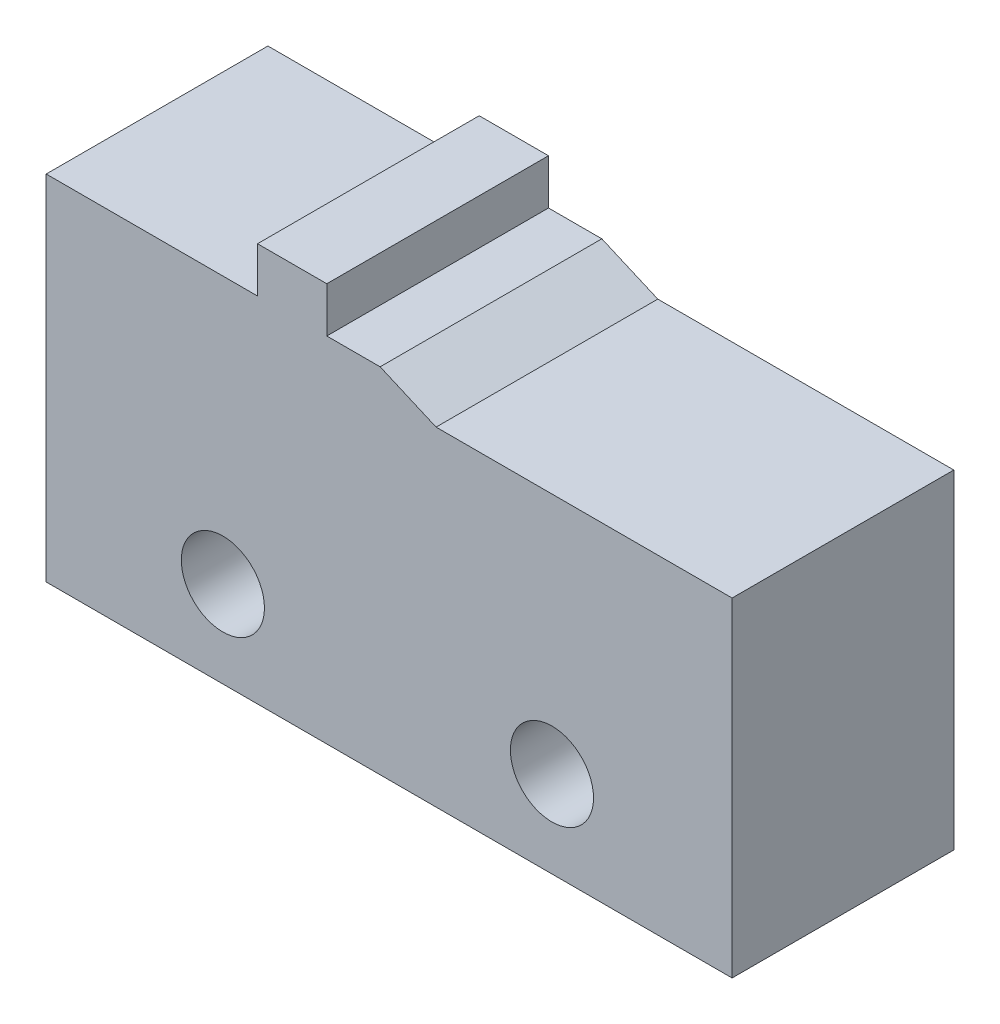
ISO-10303-21;
HEADER;
FILE_DESCRIPTION(('STEP AP214'),'2;1');
FILE_NAME('part.step','',(''),(''),'','','');
FILE_SCHEMA(('AUTOMOTIVE_DESIGN { 1 0 10303 214 1 1 1 1 }'));
ENDSEC;
DATA;
#1=APPLICATION_CONTEXT('core data for automotive mechanical design processes');
#2=APPLICATION_PROTOCOL_DEFINITION('international standard','automotive_design',2000,#1);
#3=PRODUCT_CONTEXT('',#1,'mechanical');
#4=PRODUCT('Part','Part','',(#3));
#5=PRODUCT_RELATED_PRODUCT_CATEGORY('part','',(#4));
#6=PRODUCT_DEFINITION_FORMATION('','',#4);
#7=PRODUCT_DEFINITION_CONTEXT('part definition',#1,'design');
#8=PRODUCT_DEFINITION('design','',#6,#7);
#9=PRODUCT_DEFINITION_SHAPE('','',#8);
#10=(LENGTH_UNIT() NAMED_UNIT(*) SI_UNIT(.MILLI.,.METRE.));
#11=(NAMED_UNIT(*) PLANE_ANGLE_UNIT() SI_UNIT($,.RADIAN.));
#12=(NAMED_UNIT(*) SI_UNIT($,.STERADIAN.) SOLID_ANGLE_UNIT());
#13=UNCERTAINTY_MEASURE_WITH_UNIT(LENGTH_MEASURE(1.E-05),#10,'distance_accuracy_value','');
#14=(GEOMETRIC_REPRESENTATION_CONTEXT(3) GLOBAL_UNCERTAINTY_ASSIGNED_CONTEXT((#13)) GLOBAL_UNIT_ASSIGNED_CONTEXT((#10,
#11,#12)) REPRESENTATION_CONTEXT('',''));
#15=CARTESIAN_POINT('',(0.,0.,0.));
#16=DIRECTION('',(0.,0.,1.));
#17=DIRECTION('',(1.,0.,0.));
#18=AXIS2_PLACEMENT_3D('',#15,#16,#17);
#19=CARTESIAN_POINT('',(0.,10.2,6.4));
#20=DIRECTION('',(0.,0.,-1.));
#21=DIRECTION('',(-1.,0.,0.));
#22=AXIS2_PLACEMENT_3D('',#19,#20,#21);
#23=PLANE('',#22);
#24=CARTESIAN_POINT('',(5.1,2.5,6.4));
#25=DIRECTION('',(0.,0.,1.));
#26=DIRECTION('',(1.,0.,0.));
#27=AXIS2_PLACEMENT_3D('',#24,#25,#26);
#28=CIRCLE('',#27,1.2);
#29=CARTESIAN_POINT('',(6.3,2.5,6.4));
#30=VERTEX_POINT('',#29);
#31=EDGE_CURVE('E147',#30,#30,#28,.T.);
#32=ORIENTED_EDGE('',*,*,#31,.F.);
#33=EDGE_LOOP('',(#32));
#34=FACE_BOUND('',#33,.T.);
#35=DIRECTION('',(0.,-1.,0.));
#36=VECTOR('',#35,1.);
#37=CARTESIAN_POINT('',(0.,0.,6.4));
#38=LINE('',#37,#36);
#39=CARTESIAN_POINT('',(0.,10.2,6.4));
#40=VERTEX_POINT('',#39);
#41=CARTESIAN_POINT('',(0.,0.,6.4));
#42=VERTEX_POINT('',#41);
#43=EDGE_CURVE('E162',#40,#42,#38,.T.);
#44=ORIENTED_EDGE('',*,*,#43,.T.);
#45=DIRECTION('',(1.,0.,0.));
#46=VECTOR('',#45,1.);
#47=CARTESIAN_POINT('',(0.,0.,6.4));
#48=LINE('',#47,#46);
#49=CARTESIAN_POINT('',(19.8,0.,6.4));
#50=VERTEX_POINT('',#49);
#51=EDGE_CURVE('E100',#42,#50,#48,.T.);
#52=ORIENTED_EDGE('',*,*,#51,.T.);
#53=DIRECTION('',(0.,1.,0.));
#54=VECTOR('',#53,1.);
#55=CARTESIAN_POINT('',(19.8,0.,6.4));
#56=LINE('',#55,#54);
#57=CARTESIAN_POINT('',(19.8,9.5,6.4));
#58=VERTEX_POINT('',#57);
#59=EDGE_CURVE('E183',#50,#58,#56,.T.);
#60=ORIENTED_EDGE('',*,*,#59,.T.);
#61=DIRECTION('',(-1.,0.,0.));
#62=VECTOR('',#61,1.);
#63=CARTESIAN_POINT('',(19.8,9.5,6.4));
#64=LINE('',#63,#62);
#65=CARTESIAN_POINT('',(11.254760894668,9.5,6.4));
#66=VERTEX_POINT('',#65);
#67=EDGE_CURVE('E202',#58,#66,#64,.T.);
#68=ORIENTED_EDGE('',*,*,#67,.T.);
#69=DIRECTION('',(-0.917500806613739,0.397733918421774,0.));
#70=VECTOR('',#69,1.);
#71=CARTESIAN_POINT('',(11.254760894668,9.5,6.4));
#72=LINE('',#71,#70);
#73=CARTESIAN_POINT('',(9.63998645657612,10.2,6.4));
#74=VERTEX_POINT('',#73);
#75=EDGE_CURVE('E199',#66,#74,#72,.T.);
#76=ORIENTED_EDGE('',*,*,#75,.T.);
#77=DIRECTION('',(-1.,0.,0.));
#78=VECTOR('',#77,1.);
#79=CARTESIAN_POINT('',(8.1,10.2,6.4));
#80=LINE('',#79,#78);
#81=CARTESIAN_POINT('',(8.1,10.2,6.4));
#82=VERTEX_POINT('',#81);
#83=EDGE_CURVE('E201',#74,#82,#80,.T.);
#84=ORIENTED_EDGE('',*,*,#83,.T.);
#85=DIRECTION('',(0.,1.,0.));
#86=VECTOR('',#85,1.);
#87=CARTESIAN_POINT('',(8.1,11.506737857765,6.4));
#88=LINE('',#87,#86);
#89=CARTESIAN_POINT('',(8.1,11.506737857765,6.4));
#90=VERTEX_POINT('',#89);
#91=EDGE_CURVE('E125',#82,#90,#88,.T.);
#92=ORIENTED_EDGE('',*,*,#91,.T.);
#93=DIRECTION('',(-1.,0.,0.));
#94=VECTOR('',#93,1.);
#95=CARTESIAN_POINT('',(6.1,11.506737857765,6.4));
#96=LINE('',#95,#94);
#97=CARTESIAN_POINT('',(6.1,11.506737857765,6.4));
#98=VERTEX_POINT('',#97);
#99=EDGE_CURVE('E119',#90,#98,#96,.T.);
#100=ORIENTED_EDGE('',*,*,#99,.T.);
#101=DIRECTION('',(0.,-1.,0.));
#102=VECTOR('',#101,1.);
#103=CARTESIAN_POINT('',(6.1,10.2,6.4));
#104=LINE('',#103,#102);
#105=CARTESIAN_POINT('',(6.1,10.2,6.4));
#106=VERTEX_POINT('',#105);
#107=EDGE_CURVE('E123',#98,#106,#104,.T.);
#108=ORIENTED_EDGE('',*,*,#107,.T.);
#109=DIRECTION('',(-1.,0.,0.));
#110=VECTOR('',#109,1.);
#111=CARTESIAN_POINT('',(0.,10.2,6.4));
#112=LINE('',#111,#110);
#113=EDGE_CURVE('E51',#106,#40,#112,.T.);
#114=ORIENTED_EDGE('',*,*,#113,.T.);
#115=EDGE_LOOP('',(#44,#52,#60,#68,#76,#84,#92,#100,#108,#114));
#116=FACE_BOUND('',#115,.T.);
#117=CARTESIAN_POINT('',(14.6,2.5,6.4));
#118=DIRECTION('',(0.,0.,1.));
#119=DIRECTION('',(1.,0.,0.));
#120=AXIS2_PLACEMENT_3D('',#117,#118,#119);
#121=CIRCLE('',#120,1.2);
#122=CARTESIAN_POINT('',(15.8,2.5,6.4));
#123=VERTEX_POINT('',#122);
#124=EDGE_CURVE('E213',#123,#123,#121,.T.);
#125=ORIENTED_EDGE('',*,*,#124,.F.);
#126=EDGE_LOOP('',(#125));
#127=FACE_BOUND('',#126,.T.);
#128=ADVANCED_FACE('F34',(#34,#116,#127),#23,.F.);
#129=CARTESIAN_POINT('',(0.,10.2,0.));
#130=DIRECTION('',(0.,0.,-1.));
#131=DIRECTION('',(-1.,0.,0.));
#132=AXIS2_PLACEMENT_3D('',#129,#130,#131);
#133=PLANE('',#132);
#134=CARTESIAN_POINT('',(5.1,2.5,0.));
#135=DIRECTION('',(0.,0.,1.));
#136=DIRECTION('',(1.,0.,0.));
#137=AXIS2_PLACEMENT_3D('',#134,#135,#136);
#138=CIRCLE('',#137,1.2);
#139=CARTESIAN_POINT('',(6.3,2.5,0.));
#140=VERTEX_POINT('',#139);
#141=EDGE_CURVE('E210',#140,#140,#138,.T.);
#142=ORIENTED_EDGE('',*,*,#141,.T.);
#143=EDGE_LOOP('',(#142));
#144=FACE_BOUND('',#143,.T.);
#145=DIRECTION('',(0.,-1.,0.));
#146=VECTOR('',#145,1.);
#147=CARTESIAN_POINT('',(0.,0.,0.));
#148=LINE('',#147,#146);
#149=CARTESIAN_POINT('',(0.,10.2,0.));
#150=VERTEX_POINT('',#149);
#151=CARTESIAN_POINT('',(0.,0.,0.));
#152=VERTEX_POINT('',#151);
#153=EDGE_CURVE('E143',#150,#152,#148,.T.);
#154=ORIENTED_EDGE('',*,*,#153,.F.);
#155=DIRECTION('',(-1.,0.,0.));
#156=VECTOR('',#155,1.);
#157=CARTESIAN_POINT('',(0.,10.2,0.));
#158=LINE('',#157,#156);
#159=CARTESIAN_POINT('',(6.1,10.2,0.));
#160=VERTEX_POINT('',#159);
#161=EDGE_CURVE('E92',#160,#150,#158,.T.);
#162=ORIENTED_EDGE('',*,*,#161,.F.);
#163=DIRECTION('',(0.,-1.,0.));
#164=VECTOR('',#163,1.);
#165=CARTESIAN_POINT('',(6.1,10.2,0.));
#166=LINE('',#165,#164);
#167=CARTESIAN_POINT('',(6.1,11.506737857765,0.));
#168=VERTEX_POINT('',#167);
#169=EDGE_CURVE('E86',#168,#160,#166,.T.);
#170=ORIENTED_EDGE('',*,*,#169,.F.);
#171=DIRECTION('',(-1.,0.,0.));
#172=VECTOR('',#171,1.);
#173=CARTESIAN_POINT('',(6.1,11.506737857765,0.));
#174=LINE('',#173,#172);
#175=CARTESIAN_POINT('',(8.1,11.506737857765,0.));
#176=VERTEX_POINT('',#175);
#177=EDGE_CURVE('E133',#176,#168,#174,.T.);
#178=ORIENTED_EDGE('',*,*,#177,.F.);
#179=DIRECTION('',(0.,1.,0.));
#180=VECTOR('',#179,1.);
#181=CARTESIAN_POINT('',(8.1,11.506737857765,0.));
#182=LINE('',#181,#180);
#183=CARTESIAN_POINT('',(8.1,10.2,0.));
#184=VERTEX_POINT('',#183);
#185=EDGE_CURVE('E157',#184,#176,#182,.T.);
#186=ORIENTED_EDGE('',*,*,#185,.F.);
#187=DIRECTION('',(-1.,0.,0.));
#188=VECTOR('',#187,1.);
#189=CARTESIAN_POINT('',(8.1,10.2,0.));
#190=LINE('',#189,#188);
#191=CARTESIAN_POINT('',(9.63998645657612,10.2,0.));
#192=VERTEX_POINT('',#191);
#193=EDGE_CURVE('E155',#192,#184,#190,.T.);
#194=ORIENTED_EDGE('',*,*,#193,.F.);
#195=DIRECTION('',(-0.917500806613739,0.397733918421774,0.));
#196=VECTOR('',#195,1.);
#197=CARTESIAN_POINT('',(11.254760894668,9.5,0.));
#198=LINE('',#197,#196);
#199=CARTESIAN_POINT('',(11.254760894668,9.5,0.));
#200=VERTEX_POINT('',#199);
#201=EDGE_CURVE('E153',#200,#192,#198,.T.);
#202=ORIENTED_EDGE('',*,*,#201,.F.);
#203=DIRECTION('',(-1.,0.,0.));
#204=VECTOR('',#203,1.);
#205=CARTESIAN_POINT('',(19.8,9.5,0.));
#206=LINE('',#205,#204);
#207=CARTESIAN_POINT('',(19.8,9.5,0.));
#208=VERTEX_POINT('',#207);
#209=EDGE_CURVE('E151',#208,#200,#206,.T.);
#210=ORIENTED_EDGE('',*,*,#209,.F.);
#211=DIRECTION('',(0.,1.,0.));
#212=VECTOR('',#211,1.);
#213=CARTESIAN_POINT('',(19.8,0.,0.));
#214=LINE('',#213,#212);
#215=CARTESIAN_POINT('',(19.8,0.,0.));
#216=VERTEX_POINT('',#215);
#217=EDGE_CURVE('E149',#216,#208,#214,.T.);
#218=ORIENTED_EDGE('',*,*,#217,.F.);
#219=DIRECTION('',(1.,0.,0.));
#220=VECTOR('',#219,1.);
#221=CARTESIAN_POINT('',(0.,0.,0.));
#222=LINE('',#221,#220);
#223=EDGE_CURVE('E146',#152,#216,#222,.T.);
#224=ORIENTED_EDGE('',*,*,#223,.F.);
#225=EDGE_LOOP('',(#154,#162,#170,#178,#186,#194,#202,#210,#218,#224));
#226=FACE_BOUND('',#225,.T.);
#227=CARTESIAN_POINT('',(14.6,2.5,0.));
#228=DIRECTION('',(0.,0.,1.));
#229=DIRECTION('',(1.,0.,0.));
#230=AXIS2_PLACEMENT_3D('',#227,#228,#229);
#231=CIRCLE('',#230,1.2);
#232=CARTESIAN_POINT('',(15.8,2.5,0.));
#233=VERTEX_POINT('',#232);
#234=EDGE_CURVE('E216',#233,#233,#231,.T.);
#235=ORIENTED_EDGE('',*,*,#234,.T.);
#236=EDGE_LOOP('',(#235));
#237=FACE_BOUND('',#236,.T.);
#238=ADVANCED_FACE('F187',(#144,#226,#237),#133,.T.);
#239=CARTESIAN_POINT('',(0.,0.,6.4));
#240=DIRECTION('',(1.,0.,0.));
#241=DIRECTION('',(0.,0.,-1.));
#242=AXIS2_PLACEMENT_3D('',#239,#240,#241);
#243=PLANE('',#242);
#244=ORIENTED_EDGE('',*,*,#153,.T.);
#245=DIRECTION('',(0.,0.,-1.));
#246=VECTOR('',#245,1.);
#247=CARTESIAN_POINT('',(0.,0.,6.4));
#248=LINE('',#247,#246);
#249=EDGE_CURVE('E11',#42,#152,#248,.T.);
#250=ORIENTED_EDGE('',*,*,#249,.F.);
#251=ORIENTED_EDGE('',*,*,#43,.F.);
#252=DIRECTION('',(0.,0.,-1.));
#253=VECTOR('',#252,1.);
#254=CARTESIAN_POINT('',(0.,10.2,6.4));
#255=LINE('',#254,#253);
#256=EDGE_CURVE('E139',#40,#150,#255,.T.);
#257=ORIENTED_EDGE('',*,*,#256,.T.);
#258=EDGE_LOOP('',(#244,#250,#251,#257));
#259=FACE_BOUND('',#258,.T.);
#260=ADVANCED_FACE('F36',(#259),#243,.F.);
#261=CARTESIAN_POINT('',(0.,0.,6.4));
#262=DIRECTION('',(0.,1.,0.));
#263=DIRECTION('',(0.,0.,1.));
#264=AXIS2_PLACEMENT_3D('',#261,#262,#263);
#265=PLANE('',#264);
#266=ORIENTED_EDGE('',*,*,#223,.T.);
#267=DIRECTION('',(0.,0.,-1.));
#268=VECTOR('',#267,1.);
#269=CARTESIAN_POINT('',(19.8,0.,6.4));
#270=LINE('',#269,#268);
#271=EDGE_CURVE('E43',#50,#216,#270,.T.);
#272=ORIENTED_EDGE('',*,*,#271,.F.);
#273=ORIENTED_EDGE('',*,*,#51,.F.);
#274=ORIENTED_EDGE('',*,*,#249,.T.);
#275=EDGE_LOOP('',(#266,#272,#273,#274));
#276=FACE_BOUND('',#275,.T.);
#277=ADVANCED_FACE('F257',(#276),#265,.F.);
#278=CARTESIAN_POINT('',(19.8,0.,6.4));
#279=DIRECTION('',(-1.,0.,0.));
#280=DIRECTION('',(0.,0.,1.));
#281=AXIS2_PLACEMENT_3D('',#278,#279,#280);
#282=PLANE('',#281);
#283=ORIENTED_EDGE('',*,*,#217,.T.);
#284=DIRECTION('',(0.,0.,-1.));
#285=VECTOR('',#284,1.);
#286=CARTESIAN_POINT('',(19.8,9.5,6.4));
#287=LINE('',#286,#285);
#288=EDGE_CURVE('E175',#58,#208,#287,.T.);
#289=ORIENTED_EDGE('',*,*,#288,.F.);
#290=ORIENTED_EDGE('',*,*,#59,.F.);
#291=ORIENTED_EDGE('',*,*,#271,.T.);
#292=EDGE_LOOP('',(#283,#289,#290,#291));
#293=FACE_BOUND('',#292,.T.);
#294=ADVANCED_FACE('F181',(#293),#282,.F.);
#295=CARTESIAN_POINT('',(19.8,9.5,6.4));
#296=DIRECTION('',(0.,-1.,0.));
#297=DIRECTION('',(1.,0.,0.));
#298=AXIS2_PLACEMENT_3D('',#295,#296,#297);
#299=PLANE('',#298);
#300=ORIENTED_EDGE('',*,*,#209,.T.);
#301=DIRECTION('',(0.,0.,-1.));
#302=VECTOR('',#301,1.);
#303=CARTESIAN_POINT('',(11.254760894668,9.5,6.4));
#304=LINE('',#303,#302);
#305=EDGE_CURVE('E172',#66,#200,#304,.T.);
#306=ORIENTED_EDGE('',*,*,#305,.F.);
#307=ORIENTED_EDGE('',*,*,#67,.F.);
#308=ORIENTED_EDGE('',*,*,#288,.T.);
#309=EDGE_LOOP('',(#300,#306,#307,#308));
#310=FACE_BOUND('',#309,.T.);
#311=ADVANCED_FACE('F193',(#310),#299,.F.);
#312=CARTESIAN_POINT('',(11.254760894668,9.5,6.4));
#313=DIRECTION('',(-0.397733918421774,-0.917500806613739,0.));
#314=DIRECTION('',(0.917500806613739,-0.397733918421774,0.));
#315=AXIS2_PLACEMENT_3D('',#312,#313,#314);
#316=PLANE('',#315);
#317=ORIENTED_EDGE('',*,*,#201,.T.);
#318=DIRECTION('',(0.,0.,-1.));
#319=VECTOR('',#318,1.);
#320=CARTESIAN_POINT('',(9.63998645657612,10.2,6.4));
#321=LINE('',#320,#319);
#322=EDGE_CURVE('E169',#74,#192,#321,.T.);
#323=ORIENTED_EDGE('',*,*,#322,.F.);
#324=ORIENTED_EDGE('',*,*,#75,.F.);
#325=ORIENTED_EDGE('',*,*,#305,.T.);
#326=EDGE_LOOP('',(#317,#323,#324,#325));
#327=FACE_BOUND('',#326,.T.);
#328=ADVANCED_FACE('F197',(#327),#316,.F.);
#329=CARTESIAN_POINT('',(8.1,10.2,6.4));
#330=DIRECTION('',(0.,-1.,0.));
#331=DIRECTION('',(0.,0.,-1.));
#332=AXIS2_PLACEMENT_3D('',#329,#330,#331);
#333=PLANE('',#332);
#334=ORIENTED_EDGE('',*,*,#193,.T.);
#335=DIRECTION('',(0.,0.,-1.));
#336=VECTOR('',#335,1.);
#337=CARTESIAN_POINT('',(8.1,10.2,6.4));
#338=LINE('',#337,#336);
#339=EDGE_CURVE('E166',#82,#184,#338,.T.);
#340=ORIENTED_EDGE('',*,*,#339,.F.);
#341=ORIENTED_EDGE('',*,*,#83,.F.);
#342=ORIENTED_EDGE('',*,*,#322,.T.);
#343=EDGE_LOOP('',(#334,#340,#341,#342));
#344=FACE_BOUND('',#343,.T.);
#345=ADVANCED_FACE('F247',(#344),#333,.F.);
#346=CARTESIAN_POINT('',(8.1,11.506737857765,6.4));
#347=DIRECTION('',(-1.,0.,0.));
#348=DIRECTION('',(0.,0.,1.));
#349=AXIS2_PLACEMENT_3D('',#346,#347,#348);
#350=PLANE('',#349);
#351=ORIENTED_EDGE('',*,*,#185,.T.);
#352=DIRECTION('',(0.,0.,-1.));
#353=VECTOR('',#352,1.);
#354=CARTESIAN_POINT('',(8.1,11.506737857765,6.4));
#355=LINE('',#354,#353);
#356=EDGE_CURVE('E134',#90,#176,#355,.T.);
#357=ORIENTED_EDGE('',*,*,#356,.F.);
#358=ORIENTED_EDGE('',*,*,#91,.F.);
#359=ORIENTED_EDGE('',*,*,#339,.T.);
#360=EDGE_LOOP('',(#351,#357,#358,#359));
#361=FACE_BOUND('',#360,.T.);
#362=ADVANCED_FACE('F244',(#361),#350,.F.);
#363=CARTESIAN_POINT('',(6.1,11.506737857765,6.4));
#364=DIRECTION('',(0.,-1.,0.));
#365=DIRECTION('',(0.,0.,-1.));
#366=AXIS2_PLACEMENT_3D('',#363,#364,#365);
#367=PLANE('',#366);
#368=ORIENTED_EDGE('',*,*,#177,.T.);
#369=DIRECTION('',(0.,0.,-1.));
#370=VECTOR('',#369,1.);
#371=CARTESIAN_POINT('',(6.1,11.506737857765,6.4));
#372=LINE('',#371,#370);
#373=EDGE_CURVE('E130',#98,#168,#372,.T.);
#374=ORIENTED_EDGE('',*,*,#373,.F.);
#375=ORIENTED_EDGE('',*,*,#99,.F.);
#376=ORIENTED_EDGE('',*,*,#356,.T.);
#377=EDGE_LOOP('',(#368,#374,#375,#376));
#378=FACE_BOUND('',#377,.T.);
#379=ADVANCED_FACE('F131',(#378),#367,.F.);
#380=CARTESIAN_POINT('',(6.1,10.2,6.4));
#381=DIRECTION('',(1.,0.,0.));
#382=DIRECTION('',(0.,0.,-1.));
#383=AXIS2_PLACEMENT_3D('',#380,#381,#382);
#384=PLANE('',#383);
#385=ORIENTED_EDGE('',*,*,#169,.T.);
#386=DIRECTION('',(0.,0.,-1.));
#387=VECTOR('',#386,1.);
#388=CARTESIAN_POINT('',(6.1,10.2,6.4));
#389=LINE('',#388,#387);
#390=EDGE_CURVE('E135',#106,#160,#389,.T.);
#391=ORIENTED_EDGE('',*,*,#390,.F.);
#392=ORIENTED_EDGE('',*,*,#107,.F.);
#393=ORIENTED_EDGE('',*,*,#373,.T.);
#394=EDGE_LOOP('',(#385,#391,#392,#393));
#395=FACE_BOUND('',#394,.T.);
#396=ADVANCED_FACE('F137',(#395),#384,.F.);
#397=CARTESIAN_POINT('',(0.,10.2,6.4));
#398=DIRECTION('',(0.,-1.,0.));
#399=DIRECTION('',(0.,0.,-1.));
#400=AXIS2_PLACEMENT_3D('',#397,#398,#399);
#401=PLANE('',#400);
#402=ORIENTED_EDGE('',*,*,#161,.T.);
#403=ORIENTED_EDGE('',*,*,#256,.F.);
#404=ORIENTED_EDGE('',*,*,#113,.F.);
#405=ORIENTED_EDGE('',*,*,#390,.T.);
#406=EDGE_LOOP('',(#402,#403,#404,#405));
#407=FACE_BOUND('',#406,.T.);
#408=ADVANCED_FACE('F237',(#407),#401,.F.);
#409=CARTESIAN_POINT('',(5.1,2.5,6.4));
#410=DIRECTION('',(0.,0.,-1.));
#411=DIRECTION('',(-1.,0.,0.));
#412=AXIS2_PLACEMENT_3D('',#409,#410,#411);
#413=CYLINDRICAL_SURFACE('',#412,1.2);
#414=ORIENTED_EDGE('',*,*,#31,.T.);
#415=EDGE_LOOP('',(#414));
#416=FACE_BOUND('',#415,.T.);
#417=ORIENTED_EDGE('',*,*,#141,.F.);
#418=EDGE_LOOP('',(#417));
#419=FACE_BOUND('',#418,.T.);
#420=ADVANCED_FACE('F234',(#416,#419),#413,.F.);
#421=CARTESIAN_POINT('',(14.6,2.5,6.4));
#422=DIRECTION('',(0.,0.,-1.));
#423=DIRECTION('',(-1.,0.,0.));
#424=AXIS2_PLACEMENT_3D('',#421,#422,#423);
#425=CYLINDRICAL_SURFACE('',#424,1.2);
#426=ORIENTED_EDGE('',*,*,#124,.T.);
#427=EDGE_LOOP('',(#426));
#428=FACE_BOUND('',#427,.T.);
#429=ORIENTED_EDGE('',*,*,#234,.F.);
#430=EDGE_LOOP('',(#429));
#431=FACE_BOUND('',#430,.T.);
#432=ADVANCED_FACE('F222',(#428,#431),#425,.F.);
#433=CLOSED_SHELL('',(#128,#238,#260,#277,#294,#311,#328,#345,#362,#379,#396,#408,#420,#432));
#434=MANIFOLD_SOLID_BREP('B2',#433);
#435=ADVANCED_BREP_SHAPE_REPRESENTATION('',(#18,#434),#14);
#436=SHAPE_DEFINITION_REPRESENTATION(#9,#435);
ENDSEC;
END-ISO-10303-21;
